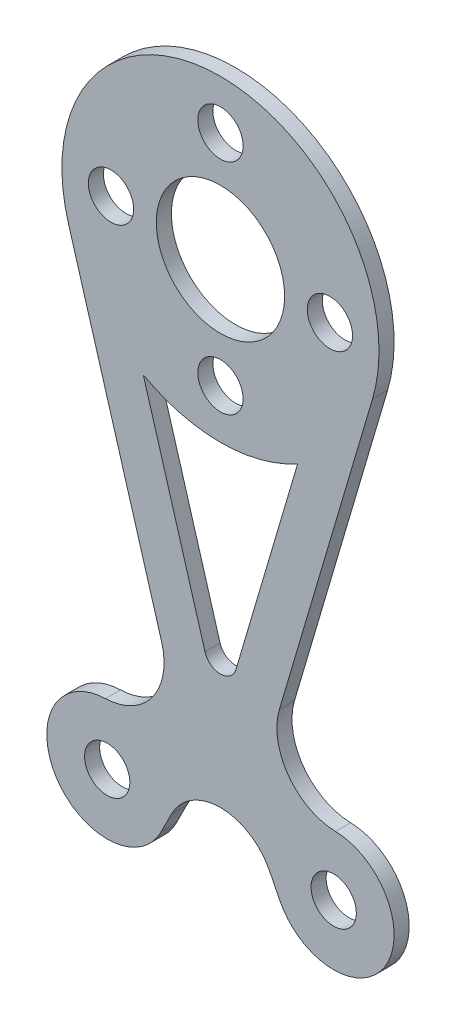
ISO-10303-21;
HEADER;
FILE_DESCRIPTION(('STEP AP214'),'2;1');
FILE_NAME('part.step','',(''),(''),'','','');
FILE_SCHEMA(('AUTOMOTIVE_DESIGN { 1 0 10303 214 1 1 1 1 }'));
ENDSEC;
DATA;
#1=APPLICATION_CONTEXT('core data for automotive mechanical design processes');
#2=APPLICATION_PROTOCOL_DEFINITION('international standard','automotive_design',2000,#1);
#3=PRODUCT_CONTEXT('',#1,'mechanical');
#4=PRODUCT('Part','Part','',(#3));
#5=PRODUCT_RELATED_PRODUCT_CATEGORY('part','',(#4));
#6=PRODUCT_DEFINITION_FORMATION('','',#4);
#7=PRODUCT_DEFINITION_CONTEXT('part definition',#1,'design');
#8=PRODUCT_DEFINITION('design','',#6,#7);
#9=PRODUCT_DEFINITION_SHAPE('','',#8);
#10=(LENGTH_UNIT() NAMED_UNIT(*) SI_UNIT(.MILLI.,.METRE.));
#11=(NAMED_UNIT(*) PLANE_ANGLE_UNIT() SI_UNIT($,.RADIAN.));
#12=(NAMED_UNIT(*) SI_UNIT($,.STERADIAN.) SOLID_ANGLE_UNIT());
#13=UNCERTAINTY_MEASURE_WITH_UNIT(LENGTH_MEASURE(1.E-05),#10,'distance_accuracy_value','');
#14=(GEOMETRIC_REPRESENTATION_CONTEXT(3) GLOBAL_UNCERTAINTY_ASSIGNED_CONTEXT((#13)) GLOBAL_UNIT_ASSIGNED_CONTEXT((#10,
#11,#12)) REPRESENTATION_CONTEXT('',''));
#15=CARTESIAN_POINT('',(0.,0.,0.));
#16=DIRECTION('',(0.,0.,1.));
#17=DIRECTION('',(1.,0.,0.));
#18=AXIS2_PLACEMENT_3D('',#15,#16,#17);
#19=CARTESIAN_POINT('',(-7.5,0.,1.));
#20=DIRECTION('',(0.,0.,1.));
#21=DIRECTION('',(1.,0.,0.));
#22=AXIS2_PLACEMENT_3D('',#19,#20,#21);
#23=PLANE('',#22);
#24=CARTESIAN_POINT('',(7.25,33.,1.));
#25=DIRECTION('',(0.,0.,1.));
#26=DIRECTION('',(1.,0.,0.));
#27=AXIS2_PLACEMENT_3D('',#24,#25,#26);
#28=CIRCLE('',#27,1.5);
#29=CARTESIAN_POINT('',(8.75,33.,1.));
#30=VERTEX_POINT('',#29);
#31=EDGE_CURVE('E172',#30,#30,#28,.T.);
#32=ORIENTED_EDGE('',*,*,#31,.F.);
#33=EDGE_LOOP('',(#32));
#34=FACE_BOUND('',#33,.T.);
#35=CARTESIAN_POINT('',(-7.25,33.,1.));
#36=DIRECTION('',(0.,0.,1.));
#37=DIRECTION('',(1.,0.,0.));
#38=AXIS2_PLACEMENT_3D('',#35,#36,#37);
#39=CIRCLE('',#38,1.5);
#40=CARTESIAN_POINT('',(-5.75,33.,1.));
#41=VERTEX_POINT('',#40);
#42=EDGE_CURVE('E184',#41,#41,#39,.T.);
#43=ORIENTED_EDGE('',*,*,#42,.F.);
#44=EDGE_LOOP('',(#43));
#45=FACE_BOUND('',#44,.T.);
#46=CARTESIAN_POINT('',(0.,33.,1.));
#47=DIRECTION('',(0.,0.,1.));
#48=DIRECTION('',(1.,0.,0.));
#49=AXIS2_PLACEMENT_3D('',#46,#47,#48);
#50=CIRCLE('',#49,4.25000000000001);
#51=CARTESIAN_POINT('',(4.25000000000001,33.,1.));
#52=VERTEX_POINT('',#51);
#53=EDGE_CURVE('E196',#52,#52,#50,.T.);
#54=ORIENTED_EDGE('',*,*,#53,.F.);
#55=EDGE_LOOP('',(#54));
#56=FACE_BOUND('',#55,.T.);
#57=CARTESIAN_POINT('',(-7.5,0.,1.));
#58=DIRECTION('',(0.,0.,1.));
#59=DIRECTION('',(1.,0.,0.));
#60=AXIS2_PLACEMENT_3D('',#57,#58,#59);
#61=CIRCLE('',#60,1.5);
#62=CARTESIAN_POINT('',(-6.,0.,1.));
#63=VERTEX_POINT('',#62);
#64=EDGE_CURVE('E208',#63,#63,#61,.T.);
#65=ORIENTED_EDGE('',*,*,#64,.F.);
#66=EDGE_LOOP('',(#65));
#67=FACE_BOUND('',#66,.T.);
#68=CARTESIAN_POINT('',(-7.5,0.,1.));
#69=DIRECTION('',(0.,0.,1.));
#70=DIRECTION('',(1.,0.,0.));
#71=AXIS2_PLACEMENT_3D('',#68,#69,#70);
#72=CIRCLE('',#71,4.);
#73=CARTESIAN_POINT('',(-7.6181358850956,3.99825510850079,1.));
#74=VERTEX_POINT('',#73);
#75=CARTESIAN_POINT('',(-3.92286350665597,-1.78999846591732,1.));
#76=VERTEX_POINT('',#75);
#77=EDGE_CURVE('E214',#74,#76,#72,.T.);
#78=ORIENTED_EDGE('',*,*,#77,.T.);
#79=DIRECTION('',(0.447499616479331,0.894284123336008,0.));
#80=VECTOR('',#79,1.);
#81=CARTESIAN_POINT('',(-3.92286350665597,-1.78999846591732,1.));
#82=LINE('',#81,#80);
#83=CARTESIAN_POINT('',(-3.25161408193697,-0.448572280913309,1.));
#84=VERTEX_POINT('',#83);
#85=EDGE_CURVE('E217',#76,#84,#82,.T.);
#86=ORIENTED_EDGE('',*,*,#85,.T.);
#87=CARTESIAN_POINT('',(0.,-2.07567938998011,1.));
#88=DIRECTION('',(0.,0.,-1.));
#89=DIRECTION('',(-1.,0.,0.));
#90=AXIS2_PLACEMENT_3D('',#87,#88,#89);
#91=CIRCLE('',#90,3.63599665597021);
#92=CARTESIAN_POINT('',(3.25161408193697,-0.448572280913309,1.));
#93=VERTEX_POINT('',#92);
#94=EDGE_CURVE('E220',#84,#93,#91,.T.);
#95=ORIENTED_EDGE('',*,*,#94,.T.);
#96=DIRECTION('',(0.447499616479331,-0.894284123336008,0.));
#97=VECTOR('',#96,1.);
#98=CARTESIAN_POINT('',(3.25161408193697,-0.448572280913309,1.));
#99=LINE('',#98,#97);
#100=CARTESIAN_POINT('',(3.92286350665597,-1.78999846591732,1.));
#101=VERTEX_POINT('',#100);
#102=EDGE_CURVE('E222',#93,#101,#99,.T.);
#103=ORIENTED_EDGE('',*,*,#102,.T.);
#104=CARTESIAN_POINT('',(7.5,0.,1.));
#105=DIRECTION('',(0.,0.,1.));
#106=DIRECTION('',(1.,0.,0.));
#107=AXIS2_PLACEMENT_3D('',#104,#105,#106);
#108=CIRCLE('',#107,4.);
#109=CARTESIAN_POINT('',(7.6181358850956,3.99825510850079,1.));
#110=VERTEX_POINT('',#109);
#111=EDGE_CURVE('E224',#101,#110,#108,.T.);
#112=ORIENTED_EDGE('',*,*,#111,.T.);
#113=CARTESIAN_POINT('',(7.73627177019119,7.99651021700159,1.));
#114=DIRECTION('',(0.,0.,-1.));
#115=DIRECTION('',(1.,0.,0.));
#116=AXIS2_PLACEMENT_3D('',#113,#114,#115);
#117=CIRCLE('',#116,4.);
#118=CARTESIAN_POINT('',(3.9,9.12921446138055,1.));
#119=VERTEX_POINT('',#118);
#120=EDGE_CURVE('E226',#110,#119,#117,.T.);
#121=ORIENTED_EDGE('',*,*,#120,.T.);
#122=DIRECTION('',(0.283176061094742,0.959067942547798,0.));
#123=VECTOR('',#122,1.);
#124=CARTESIAN_POINT('',(10.0702133967519,30.0266513585052,1.));
#125=LINE('',#124,#123);
#126=CARTESIAN_POINT('',(10.0702133967519,30.0266513585052,1.));
#127=VERTEX_POINT('',#126);
#128=EDGE_CURVE('E228',#119,#127,#125,.T.);
#129=ORIENTED_EDGE('',*,*,#128,.T.);
#130=CARTESIAN_POINT('',(0.,33.,1.));
#131=DIRECTION('',(0.,0.,1.));
#132=DIRECTION('',(1.,0.,0.));
#133=AXIS2_PLACEMENT_3D('',#130,#131,#132);
#134=CIRCLE('',#133,10.5);
#135=CARTESIAN_POINT('',(-10.0702133967519,30.0266513585052,1.));
#136=VERTEX_POINT('',#135);
#137=EDGE_CURVE('E230',#127,#136,#134,.T.);
#138=ORIENTED_EDGE('',*,*,#137,.T.);
#139=DIRECTION('',(0.283176061094742,-0.959067942547798,0.));
#140=VECTOR('',#139,1.);
#141=CARTESIAN_POINT('',(-10.0702133967519,30.0266513585052,1.));
#142=LINE('',#141,#140);
#143=CARTESIAN_POINT('',(-3.9,9.12921446138055,1.));
#144=VERTEX_POINT('',#143);
#145=EDGE_CURVE('E232',#136,#144,#142,.T.);
#146=ORIENTED_EDGE('',*,*,#145,.T.);
#147=CARTESIAN_POINT('',(-7.73627177019119,7.99651021700159,1.));
#148=DIRECTION('',(0.,0.,-1.));
#149=DIRECTION('',(-1.,0.,0.));
#150=AXIS2_PLACEMENT_3D('',#147,#148,#149);
#151=CIRCLE('',#150,4.);
#152=EDGE_CURVE('E234',#144,#74,#151,.T.);
#153=ORIENTED_EDGE('',*,*,#152,.T.);
#154=EDGE_LOOP('',(#78,#86,#95,#103,#112,#121,#129,#138,#146,#153));
#155=FACE_BOUND('',#154,.T.);
#156=CARTESIAN_POINT('',(7.5,0.,1.));
#157=DIRECTION('',(0.,0.,1.));
#158=DIRECTION('',(1.,0.,0.));
#159=AXIS2_PLACEMENT_3D('',#156,#157,#158);
#160=CIRCLE('',#159,1.5);
#161=CARTESIAN_POINT('',(9.,0.,1.));
#162=VERTEX_POINT('',#161);
#163=EDGE_CURVE('E202',#162,#162,#160,.T.);
#164=ORIENTED_EDGE('',*,*,#163,.F.);
#165=EDGE_LOOP('',(#164));
#166=FACE_BOUND('',#165,.T.);
#167=CARTESIAN_POINT('',(0.,40.25,1.));
#168=DIRECTION('',(0.,0.,1.));
#169=DIRECTION('',(1.,0.,0.));
#170=AXIS2_PLACEMENT_3D('',#167,#168,#169);
#171=CIRCLE('',#170,1.5);
#172=CARTESIAN_POINT('',(1.5,40.25,1.));
#173=VERTEX_POINT('',#172);
#174=EDGE_CURVE('E190',#173,#173,#171,.T.);
#175=ORIENTED_EDGE('',*,*,#174,.F.);
#176=EDGE_LOOP('',(#175));
#177=FACE_BOUND('',#176,.T.);
#178=CARTESIAN_POINT('',(0.,25.75,1.));
#179=DIRECTION('',(0.,0.,1.));
#180=DIRECTION('',(1.,0.,0.));
#181=AXIS2_PLACEMENT_3D('',#178,#179,#180);
#182=CIRCLE('',#181,1.5);
#183=CARTESIAN_POINT('',(1.5,25.75,1.));
#184=VERTEX_POINT('',#183);
#185=EDGE_CURVE('E178',#184,#184,#182,.T.);
#186=ORIENTED_EDGE('',*,*,#185,.F.);
#187=EDGE_LOOP('',(#186));
#188=FACE_BOUND('',#187,.T.);
#189=DIRECTION('',(0.283176061094742,-0.959067942547798,0.));
#190=VECTOR('',#189,1.);
#191=CARTESIAN_POINT('',(-5.11209899794855,23.8284982780804,1.));
#192=LINE('',#191,#190);
#193=CARTESIAN_POINT('',(-5.11209899794855,23.8284982780804,1.));
#194=VERTEX_POINT('',#193);
#195=CARTESIAN_POINT('',(-1.0227961723566,9.97874264466478,1.));
#196=VERTEX_POINT('',#195);
#197=EDGE_CURVE('E144',#194,#196,#192,.T.);
#198=ORIENTED_EDGE('',*,*,#197,.F.);
#199=CARTESIAN_POINT('',(0.,33.,1.));
#200=DIRECTION('',(0.,0.,-1.));
#201=DIRECTION('',(1.,0.,0.));
#202=AXIS2_PLACEMENT_3D('',#199,#200,#201);
#203=CIRCLE('',#202,10.5);
#204=CARTESIAN_POINT('',(5.11209899794854,23.8284982780804,1.));
#205=VERTEX_POINT('',#204);
#206=EDGE_CURVE('E136',#205,#194,#203,.T.);
#207=ORIENTED_EDGE('',*,*,#206,.F.);
#208=DIRECTION('',(0.283176061094742,0.959067942547798,0.));
#209=VECTOR('',#208,1.);
#210=CARTESIAN_POINT('',(5.11209899794854,23.8284982780804,1.));
#211=LINE('',#210,#209);
#212=CARTESIAN_POINT('',(1.0227961723566,9.97874264466478,1.));
#213=VERTEX_POINT('',#212);
#214=EDGE_CURVE('E158',#213,#205,#211,.T.);
#215=ORIENTED_EDGE('',*,*,#214,.F.);
#216=CARTESIAN_POINT('',(0.,10.2807352132218,1.));
#217=DIRECTION('',(0.,0.,1.));
#218=DIRECTION('',(1.,0.,0.));
#219=AXIS2_PLACEMENT_3D('',#216,#217,#218);
#220=CIRCLE('',#219,1.06644808671168);
#221=EDGE_CURVE('E156',#196,#213,#220,.T.);
#222=ORIENTED_EDGE('',*,*,#221,.F.);
#223=EDGE_LOOP('',(#198,#207,#215,#222));
#224=FACE_BOUND('',#223,.T.);
#225=ADVANCED_FACE('F35',(#34,#45,#56,#67,#155,#166,#177,#188,#224),#23,.T.);
#226=CARTESIAN_POINT('',(-7.5,0.,0.));
#227=DIRECTION('',(0.,0.,1.));
#228=DIRECTION('',(1.,0.,0.));
#229=AXIS2_PLACEMENT_3D('',#226,#227,#228);
#230=PLANE('',#229);
#231=CARTESIAN_POINT('',(7.25,33.,0.));
#232=DIRECTION('',(0.,0.,1.));
#233=DIRECTION('',(1.,0.,0.));
#234=AXIS2_PLACEMENT_3D('',#231,#232,#233);
#235=CIRCLE('',#234,1.5);
#236=CARTESIAN_POINT('',(8.75,33.,0.));
#237=VERTEX_POINT('',#236);
#238=EDGE_CURVE('E152',#237,#237,#235,.T.);
#239=ORIENTED_EDGE('',*,*,#238,.T.);
#240=EDGE_LOOP('',(#239));
#241=FACE_BOUND('',#240,.T.);
#242=CARTESIAN_POINT('',(-7.25,33.,0.));
#243=DIRECTION('',(0.,0.,1.));
#244=DIRECTION('',(1.,0.,0.));
#245=AXIS2_PLACEMENT_3D('',#242,#243,#244);
#246=CIRCLE('',#245,1.5);
#247=CARTESIAN_POINT('',(-5.75,33.,0.));
#248=VERTEX_POINT('',#247);
#249=EDGE_CURVE('E181',#248,#248,#246,.T.);
#250=ORIENTED_EDGE('',*,*,#249,.T.);
#251=EDGE_LOOP('',(#250));
#252=FACE_BOUND('',#251,.T.);
#253=CARTESIAN_POINT('',(0.,33.,0.));
#254=DIRECTION('',(0.,0.,1.));
#255=DIRECTION('',(1.,0.,0.));
#256=AXIS2_PLACEMENT_3D('',#253,#254,#255);
#257=CIRCLE('',#256,4.25000000000001);
#258=CARTESIAN_POINT('',(4.25000000000001,33.,0.));
#259=VERTEX_POINT('',#258);
#260=EDGE_CURVE('E193',#259,#259,#257,.T.);
#261=ORIENTED_EDGE('',*,*,#260,.T.);
#262=EDGE_LOOP('',(#261));
#263=FACE_BOUND('',#262,.T.);
#264=CARTESIAN_POINT('',(-7.5,0.,0.));
#265=DIRECTION('',(0.,0.,1.));
#266=DIRECTION('',(1.,0.,0.));
#267=AXIS2_PLACEMENT_3D('',#264,#265,#266);
#268=CIRCLE('',#267,1.5);
#269=CARTESIAN_POINT('',(-6.,0.,0.));
#270=VERTEX_POINT('',#269);
#271=EDGE_CURVE('E205',#270,#270,#268,.T.);
#272=ORIENTED_EDGE('',*,*,#271,.T.);
#273=EDGE_LOOP('',(#272));
#274=FACE_BOUND('',#273,.T.);
#275=CARTESIAN_POINT('',(-7.5,0.,0.));
#276=DIRECTION('',(0.,0.,1.));
#277=DIRECTION('',(1.,0.,0.));
#278=AXIS2_PLACEMENT_3D('',#275,#276,#277);
#279=CIRCLE('',#278,4.);
#280=CARTESIAN_POINT('',(-7.6181358850956,3.99825510850079,0.));
#281=VERTEX_POINT('',#280);
#282=CARTESIAN_POINT('',(-3.92286350665597,-1.78999846591732,0.));
#283=VERTEX_POINT('',#282);
#284=EDGE_CURVE('E211',#281,#283,#279,.T.);
#285=ORIENTED_EDGE('',*,*,#284,.F.);
#286=CARTESIAN_POINT('',(-7.73627177019119,7.99651021700159,0.));
#287=DIRECTION('',(0.,0.,-1.));
#288=DIRECTION('',(-1.,0.,0.));
#289=AXIS2_PLACEMENT_3D('',#286,#287,#288);
#290=CIRCLE('',#289,4.);
#291=CARTESIAN_POINT('',(-3.9,9.12921446138055,0.));
#292=VERTEX_POINT('',#291);
#293=EDGE_CURVE('E218',#292,#281,#290,.T.);
#294=ORIENTED_EDGE('',*,*,#293,.F.);
#295=DIRECTION('',(0.283176061094742,-0.959067942547798,0.));
#296=VECTOR('',#295,1.);
#297=CARTESIAN_POINT('',(-10.0702133967519,30.0266513585052,0.));
#298=LINE('',#297,#296);
#299=CARTESIAN_POINT('',(-10.0702133967519,30.0266513585052,0.));
#300=VERTEX_POINT('',#299);
#301=EDGE_CURVE('E253',#300,#292,#298,.T.);
#302=ORIENTED_EDGE('',*,*,#301,.F.);
#303=CARTESIAN_POINT('',(0.,33.,0.));
#304=DIRECTION('',(0.,0.,1.));
#305=DIRECTION('',(1.,0.,0.));
#306=AXIS2_PLACEMENT_3D('',#303,#304,#305);
#307=CIRCLE('',#306,10.5);
#308=CARTESIAN_POINT('',(10.0702133967519,30.0266513585052,0.));
#309=VERTEX_POINT('',#308);
#310=EDGE_CURVE('E251',#309,#300,#307,.T.);
#311=ORIENTED_EDGE('',*,*,#310,.F.);
#312=DIRECTION('',(0.283176061094742,0.959067942547798,0.));
#313=VECTOR('',#312,1.);
#314=CARTESIAN_POINT('',(10.0702133967519,30.0266513585052,0.));
#315=LINE('',#314,#313);
#316=CARTESIAN_POINT('',(3.9,9.12921446138055,0.));
#317=VERTEX_POINT('',#316);
#318=EDGE_CURVE('E249',#317,#309,#315,.T.);
#319=ORIENTED_EDGE('',*,*,#318,.F.);
#320=CARTESIAN_POINT('',(7.73627177019119,7.99651021700159,0.));
#321=DIRECTION('',(0.,0.,-1.));
#322=DIRECTION('',(1.,0.,0.));
#323=AXIS2_PLACEMENT_3D('',#320,#321,#322);
#324=CIRCLE('',#323,4.);
#325=CARTESIAN_POINT('',(7.6181358850956,3.99825510850079,0.));
#326=VERTEX_POINT('',#325);
#327=EDGE_CURVE('E247',#326,#317,#324,.T.);
#328=ORIENTED_EDGE('',*,*,#327,.F.);
#329=CARTESIAN_POINT('',(7.5,0.,0.));
#330=DIRECTION('',(0.,0.,1.));
#331=DIRECTION('',(1.,0.,0.));
#332=AXIS2_PLACEMENT_3D('',#329,#330,#331);
#333=CIRCLE('',#332,4.);
#334=CARTESIAN_POINT('',(3.92286350665597,-1.78999846591732,0.));
#335=VERTEX_POINT('',#334);
#336=EDGE_CURVE('E245',#335,#326,#333,.T.);
#337=ORIENTED_EDGE('',*,*,#336,.F.);
#338=DIRECTION('',(0.447499616479331,-0.894284123336008,0.));
#339=VECTOR('',#338,1.);
#340=CARTESIAN_POINT('',(3.25161408193697,-0.448572280913309,0.));
#341=LINE('',#340,#339);
#342=CARTESIAN_POINT('',(3.25161408193697,-0.448572280913309,0.));
#343=VERTEX_POINT('',#342);
#344=EDGE_CURVE('E243',#343,#335,#341,.T.);
#345=ORIENTED_EDGE('',*,*,#344,.F.);
#346=CARTESIAN_POINT('',(0.,-2.07567938998011,0.));
#347=DIRECTION('',(0.,0.,-1.));
#348=DIRECTION('',(-1.,0.,0.));
#349=AXIS2_PLACEMENT_3D('',#346,#347,#348);
#350=CIRCLE('',#349,3.63599665597021);
#351=CARTESIAN_POINT('',(-3.25161408193697,-0.448572280913309,0.));
#352=VERTEX_POINT('',#351);
#353=EDGE_CURVE('E241',#352,#343,#350,.T.);
#354=ORIENTED_EDGE('',*,*,#353,.F.);
#355=DIRECTION('',(0.447499616479331,0.894284123336008,0.));
#356=VECTOR('',#355,1.);
#357=CARTESIAN_POINT('',(-3.92286350665597,-1.78999846591732,0.));
#358=LINE('',#357,#356);
#359=EDGE_CURVE('E239',#283,#352,#358,.T.);
#360=ORIENTED_EDGE('',*,*,#359,.F.);
#361=EDGE_LOOP('',(#285,#294,#302,#311,#319,#328,#337,#345,#354,#360));
#362=FACE_BOUND('',#361,.T.);
#363=CARTESIAN_POINT('',(7.5,0.,0.));
#364=DIRECTION('',(0.,0.,1.));
#365=DIRECTION('',(1.,0.,0.));
#366=AXIS2_PLACEMENT_3D('',#363,#364,#365);
#367=CIRCLE('',#366,1.5);
#368=CARTESIAN_POINT('',(9.,0.,0.));
#369=VERTEX_POINT('',#368);
#370=EDGE_CURVE('E199',#369,#369,#367,.T.);
#371=ORIENTED_EDGE('',*,*,#370,.T.);
#372=EDGE_LOOP('',(#371));
#373=FACE_BOUND('',#372,.T.);
#374=CARTESIAN_POINT('',(0.,40.25,0.));
#375=DIRECTION('',(0.,0.,1.));
#376=DIRECTION('',(1.,0.,0.));
#377=AXIS2_PLACEMENT_3D('',#374,#375,#376);
#378=CIRCLE('',#377,1.5);
#379=CARTESIAN_POINT('',(1.5,40.25,0.));
#380=VERTEX_POINT('',#379);
#381=EDGE_CURVE('E187',#380,#380,#378,.T.);
#382=ORIENTED_EDGE('',*,*,#381,.T.);
#383=EDGE_LOOP('',(#382));
#384=FACE_BOUND('',#383,.T.);
#385=CARTESIAN_POINT('',(0.,25.75,0.));
#386=DIRECTION('',(0.,0.,1.));
#387=DIRECTION('',(1.,0.,0.));
#388=AXIS2_PLACEMENT_3D('',#385,#386,#387);
#389=CIRCLE('',#388,1.5);
#390=CARTESIAN_POINT('',(1.5,25.75,0.));
#391=VERTEX_POINT('',#390);
#392=EDGE_CURVE('E175',#391,#391,#389,.T.);
#393=ORIENTED_EDGE('',*,*,#392,.T.);
#394=EDGE_LOOP('',(#393));
#395=FACE_BOUND('',#394,.T.);
#396=CARTESIAN_POINT('',(0.,33.,0.));
#397=DIRECTION('',(0.,0.,-1.));
#398=DIRECTION('',(1.,0.,0.));
#399=AXIS2_PLACEMENT_3D('',#396,#397,#398);
#400=CIRCLE('',#399,10.5);
#401=CARTESIAN_POINT('',(5.11209899794854,23.8284982780804,0.));
#402=VERTEX_POINT('',#401);
#403=CARTESIAN_POINT('',(-5.11209899794855,23.8284982780804,0.));
#404=VERTEX_POINT('',#403);
#405=EDGE_CURVE('E58',#402,#404,#400,.T.);
#406=ORIENTED_EDGE('',*,*,#405,.T.);
#407=DIRECTION('',(0.283176061094742,-0.959067942547798,0.));
#408=VECTOR('',#407,1.);
#409=CARTESIAN_POINT('',(-5.11209899794855,23.8284982780804,0.));
#410=LINE('',#409,#408);
#411=CARTESIAN_POINT('',(-1.0227961723566,9.97874264466478,0.));
#412=VERTEX_POINT('',#411);
#413=EDGE_CURVE('E151',#404,#412,#410,.T.);
#414=ORIENTED_EDGE('',*,*,#413,.T.);
#415=CARTESIAN_POINT('',(0.,10.2807352132218,0.));
#416=DIRECTION('',(0.,0.,1.));
#417=DIRECTION('',(1.,0.,0.));
#418=AXIS2_PLACEMENT_3D('',#415,#416,#417);
#419=CIRCLE('',#418,1.06644808671168);
#420=CARTESIAN_POINT('',(1.0227961723566,9.97874264466478,0.));
#421=VERTEX_POINT('',#420);
#422=EDGE_CURVE('E164',#412,#421,#419,.T.);
#423=ORIENTED_EDGE('',*,*,#422,.T.);
#424=DIRECTION('',(0.283176061094742,0.959067942547798,0.));
#425=VECTOR('',#424,1.);
#426=CARTESIAN_POINT('',(5.11209899794854,23.8284982780804,0.));
#427=LINE('',#426,#425);
#428=EDGE_CURVE('E145',#421,#402,#427,.T.);
#429=ORIENTED_EDGE('',*,*,#428,.T.);
#430=EDGE_LOOP('',(#406,#414,#423,#429));
#431=FACE_BOUND('',#430,.T.);
#432=ADVANCED_FACE('F289',(#241,#252,#263,#274,#362,#373,#384,#395,#431),#230,.F.);
#433=CARTESIAN_POINT('',(-7.5,0.,1.));
#434=DIRECTION('',(0.,0.,-1.));
#435=DIRECTION('',(-1.,0.,0.));
#436=AXIS2_PLACEMENT_3D('',#433,#434,#435);
#437=CYLINDRICAL_SURFACE('',#436,4.);
#438=ORIENTED_EDGE('',*,*,#284,.T.);
#439=DIRECTION('',(0.,0.,-1.));
#440=VECTOR('',#439,1.);
#441=CARTESIAN_POINT('',(-3.92286350665597,-1.78999846591732,1.));
#442=LINE('',#441,#440);
#443=EDGE_CURVE('E11',#76,#283,#442,.T.);
#444=ORIENTED_EDGE('',*,*,#443,.F.);
#445=ORIENTED_EDGE('',*,*,#77,.F.);
#446=DIRECTION('',(0.,0.,-1.));
#447=VECTOR('',#446,1.);
#448=CARTESIAN_POINT('',(-7.6181358850956,3.99825510850079,1.));
#449=LINE('',#448,#447);
#450=EDGE_CURVE('E236',#74,#281,#449,.T.);
#451=ORIENTED_EDGE('',*,*,#450,.T.);
#452=EDGE_LOOP('',(#438,#444,#445,#451));
#453=FACE_BOUND('',#452,.T.);
#454=ADVANCED_FACE('F37',(#453),#437,.T.);
#455=CARTESIAN_POINT('',(-3.92286350665597,-1.78999846591732,1.));
#456=DIRECTION('',(-0.894284123336008,0.447499616479331,0.));
#457=DIRECTION('',(-0.447499616479331,-0.894284123336008,0.));
#458=AXIS2_PLACEMENT_3D('',#455,#456,#457);
#459=PLANE('',#458);
#460=ORIENTED_EDGE('',*,*,#359,.T.);
#461=DIRECTION('',(0.,0.,-1.));
#462=VECTOR('',#461,1.);
#463=CARTESIAN_POINT('',(-3.25161408193697,-0.448572280913309,1.));
#464=LINE('',#463,#462);
#465=EDGE_CURVE('E43',#84,#352,#464,.T.);
#466=ORIENTED_EDGE('',*,*,#465,.F.);
#467=ORIENTED_EDGE('',*,*,#85,.F.);
#468=ORIENTED_EDGE('',*,*,#443,.T.);
#469=EDGE_LOOP('',(#460,#466,#467,#468));
#470=FACE_BOUND('',#469,.T.);
#471=ADVANCED_FACE('F307',(#470),#459,.F.);
#472=CARTESIAN_POINT('',(0.,-2.07567938998011,1.));
#473=DIRECTION('',(0.,0.,-1.));
#474=DIRECTION('',(-1.,0.,0.));
#475=AXIS2_PLACEMENT_3D('',#472,#473,#474);
#476=CYLINDRICAL_SURFACE('',#475,3.63599665597021);
#477=ORIENTED_EDGE('',*,*,#353,.T.);
#478=DIRECTION('',(0.,0.,-1.));
#479=VECTOR('',#478,1.);
#480=CARTESIAN_POINT('',(3.25161408193697,-0.448572280913309,1.));
#481=LINE('',#480,#479);
#482=EDGE_CURVE('E276',#93,#343,#481,.T.);
#483=ORIENTED_EDGE('',*,*,#482,.F.);
#484=ORIENTED_EDGE('',*,*,#94,.F.);
#485=ORIENTED_EDGE('',*,*,#465,.T.);
#486=EDGE_LOOP('',(#477,#483,#484,#485));
#487=FACE_BOUND('',#486,.T.);
#488=ADVANCED_FACE('F283',(#487),#476,.F.);
#489=CARTESIAN_POINT('',(3.25161408193697,-0.448572280913309,1.));
#490=DIRECTION('',(0.894284123336008,0.447499616479331,0.));
#491=DIRECTION('',(-0.447499616479331,0.894284123336008,0.));
#492=AXIS2_PLACEMENT_3D('',#489,#490,#491);
#493=PLANE('',#492);
#494=ORIENTED_EDGE('',*,*,#344,.T.);
#495=DIRECTION('',(0.,0.,-1.));
#496=VECTOR('',#495,1.);
#497=CARTESIAN_POINT('',(3.92286350665597,-1.78999846591732,1.));
#498=LINE('',#497,#496);
#499=EDGE_CURVE('E273',#101,#335,#498,.T.);
#500=ORIENTED_EDGE('',*,*,#499,.F.);
#501=ORIENTED_EDGE('',*,*,#102,.F.);
#502=ORIENTED_EDGE('',*,*,#482,.T.);
#503=EDGE_LOOP('',(#494,#500,#501,#502));
#504=FACE_BOUND('',#503,.T.);
#505=ADVANCED_FACE('F295',(#504),#493,.F.);
#506=CARTESIAN_POINT('',(7.5,0.,1.));
#507=DIRECTION('',(0.,0.,-1.));
#508=DIRECTION('',(-1.,0.,0.));
#509=AXIS2_PLACEMENT_3D('',#506,#507,#508);
#510=CYLINDRICAL_SURFACE('',#509,4.);
#511=ORIENTED_EDGE('',*,*,#336,.T.);
#512=DIRECTION('',(0.,0.,-1.));
#513=VECTOR('',#512,1.);
#514=CARTESIAN_POINT('',(7.6181358850956,3.99825510850079,1.));
#515=LINE('',#514,#513);
#516=EDGE_CURVE('E270',#110,#326,#515,.T.);
#517=ORIENTED_EDGE('',*,*,#516,.F.);
#518=ORIENTED_EDGE('',*,*,#111,.F.);
#519=ORIENTED_EDGE('',*,*,#499,.T.);
#520=EDGE_LOOP('',(#511,#517,#518,#519));
#521=FACE_BOUND('',#520,.T.);
#522=ADVANCED_FACE('F299',(#521),#510,.T.);
#523=CARTESIAN_POINT('',(7.73627177019119,7.99651021700159,1.));
#524=DIRECTION('',(0.,0.,-1.));
#525=DIRECTION('',(-1.,0.,0.));
#526=AXIS2_PLACEMENT_3D('',#523,#524,#525);
#527=CYLINDRICAL_SURFACE('',#526,4.);
#528=ORIENTED_EDGE('',*,*,#327,.T.);
#529=DIRECTION('',(0.,0.,-1.));
#530=VECTOR('',#529,1.);
#531=CARTESIAN_POINT('',(3.9,9.12921446138055,1.));
#532=LINE('',#531,#530);
#533=EDGE_CURVE('E267',#119,#317,#532,.T.);
#534=ORIENTED_EDGE('',*,*,#533,.F.);
#535=ORIENTED_EDGE('',*,*,#120,.F.);
#536=ORIENTED_EDGE('',*,*,#516,.T.);
#537=EDGE_LOOP('',(#528,#534,#535,#536));
#538=FACE_BOUND('',#537,.T.);
#539=ADVANCED_FACE('F330',(#538),#527,.F.);
#540=CARTESIAN_POINT('',(10.0702133967519,30.0266513585052,1.));
#541=DIRECTION('',(-0.959067942547798,0.283176061094742,0.));
#542=DIRECTION('',(-0.283176061094742,-0.959067942547798,0.));
#543=AXIS2_PLACEMENT_3D('',#540,#541,#542);
#544=PLANE('',#543);
#545=ORIENTED_EDGE('',*,*,#318,.T.);
#546=DIRECTION('',(0.,0.,-1.));
#547=VECTOR('',#546,1.);
#548=CARTESIAN_POINT('',(10.0702133967519,30.0266513585052,1.));
#549=LINE('',#548,#547);
#550=EDGE_CURVE('E264',#127,#309,#549,.T.);
#551=ORIENTED_EDGE('',*,*,#550,.F.);
#552=ORIENTED_EDGE('',*,*,#128,.F.);
#553=ORIENTED_EDGE('',*,*,#533,.T.);
#554=EDGE_LOOP('',(#545,#551,#552,#553));
#555=FACE_BOUND('',#554,.T.);
#556=ADVANCED_FACE('F327',(#555),#544,.F.);
#557=CARTESIAN_POINT('',(0.,33.,1.));
#558=DIRECTION('',(0.,0.,-1.));
#559=DIRECTION('',(-1.,0.,0.));
#560=AXIS2_PLACEMENT_3D('',#557,#558,#559);
#561=CYLINDRICAL_SURFACE('',#560,10.5);
#562=ORIENTED_EDGE('',*,*,#310,.T.);
#563=DIRECTION('',(0.,0.,-1.));
#564=VECTOR('',#563,1.);
#565=CARTESIAN_POINT('',(-10.0702133967519,30.0266513585052,1.));
#566=LINE('',#565,#564);
#567=EDGE_CURVE('E261',#136,#300,#566,.T.);
#568=ORIENTED_EDGE('',*,*,#567,.F.);
#569=ORIENTED_EDGE('',*,*,#137,.F.);
#570=ORIENTED_EDGE('',*,*,#550,.T.);
#571=EDGE_LOOP('',(#562,#568,#569,#570));
#572=FACE_BOUND('',#571,.T.);
#573=ADVANCED_FACE('F323',(#572),#561,.T.);
#574=CARTESIAN_POINT('',(-10.0702133967519,30.0266513585052,1.));
#575=DIRECTION('',(0.959067942547798,0.283176061094742,0.));
#576=DIRECTION('',(-0.283176061094742,0.959067942547798,0.));
#577=AXIS2_PLACEMENT_3D('',#574,#575,#576);
#578=PLANE('',#577);
#579=ORIENTED_EDGE('',*,*,#301,.T.);
#580=DIRECTION('',(0.,0.,-1.));
#581=VECTOR('',#580,1.);
#582=CARTESIAN_POINT('',(-3.9,9.12921446138055,1.));
#583=LINE('',#582,#581);
#584=EDGE_CURVE('E258',#144,#292,#583,.T.);
#585=ORIENTED_EDGE('',*,*,#584,.F.);
#586=ORIENTED_EDGE('',*,*,#145,.F.);
#587=ORIENTED_EDGE('',*,*,#567,.T.);
#588=EDGE_LOOP('',(#579,#585,#586,#587));
#589=FACE_BOUND('',#588,.T.);
#590=ADVANCED_FACE('F319',(#589),#578,.F.);
#591=CARTESIAN_POINT('',(-7.73627177019119,7.99651021700159,1.));
#592=DIRECTION('',(0.,0.,-1.));
#593=DIRECTION('',(-1.,0.,0.));
#594=AXIS2_PLACEMENT_3D('',#591,#592,#593);
#595=CYLINDRICAL_SURFACE('',#594,4.);
#596=ORIENTED_EDGE('',*,*,#293,.T.);
#597=ORIENTED_EDGE('',*,*,#450,.F.);
#598=ORIENTED_EDGE('',*,*,#152,.F.);
#599=ORIENTED_EDGE('',*,*,#584,.T.);
#600=EDGE_LOOP('',(#596,#597,#598,#599));
#601=FACE_BOUND('',#600,.T.);
#602=ADVANCED_FACE('F314',(#601),#595,.F.);
#603=CARTESIAN_POINT('',(-7.5,0.,1.));
#604=DIRECTION('',(0.,0.,-1.));
#605=DIRECTION('',(-1.,0.,0.));
#606=AXIS2_PLACEMENT_3D('',#603,#604,#605);
#607=CYLINDRICAL_SURFACE('',#606,1.5);
#608=ORIENTED_EDGE('',*,*,#64,.T.);
#609=EDGE_LOOP('',(#608));
#610=FACE_BOUND('',#609,.T.);
#611=ORIENTED_EDGE('',*,*,#271,.F.);
#612=EDGE_LOOP('',(#611));
#613=FACE_BOUND('',#612,.T.);
#614=ADVANCED_FACE('F350',(#610,#613),#607,.F.);
#615=CARTESIAN_POINT('',(7.5,0.,1.));
#616=DIRECTION('',(0.,0.,-1.));
#617=DIRECTION('',(-1.,0.,0.));
#618=AXIS2_PLACEMENT_3D('',#615,#616,#617);
#619=CYLINDRICAL_SURFACE('',#618,1.5);
#620=ORIENTED_EDGE('',*,*,#163,.T.);
#621=EDGE_LOOP('',(#620));
#622=FACE_BOUND('',#621,.T.);
#623=ORIENTED_EDGE('',*,*,#370,.F.);
#624=EDGE_LOOP('',(#623));
#625=FACE_BOUND('',#624,.T.);
#626=ADVANCED_FACE('F376',(#622,#625),#619,.F.);
#627=CARTESIAN_POINT('',(0.,33.,1.));
#628=DIRECTION('',(0.,0.,-1.));
#629=DIRECTION('',(-1.,0.,0.));
#630=AXIS2_PLACEMENT_3D('',#627,#628,#629);
#631=CYLINDRICAL_SURFACE('',#630,4.25000000000001);
#632=ORIENTED_EDGE('',*,*,#53,.T.);
#633=EDGE_LOOP('',(#632));
#634=FACE_BOUND('',#633,.T.);
#635=ORIENTED_EDGE('',*,*,#260,.F.);
#636=EDGE_LOOP('',(#635));
#637=FACE_BOUND('',#636,.T.);
#638=ADVANCED_FACE('F383',(#634,#637),#631,.F.);
#639=CARTESIAN_POINT('',(0.,40.25,1.));
#640=DIRECTION('',(0.,0.,-1.));
#641=DIRECTION('',(-1.,0.,0.));
#642=AXIS2_PLACEMENT_3D('',#639,#640,#641);
#643=CYLINDRICAL_SURFACE('',#642,1.5);
#644=ORIENTED_EDGE('',*,*,#174,.T.);
#645=EDGE_LOOP('',(#644));
#646=FACE_BOUND('',#645,.T.);
#647=ORIENTED_EDGE('',*,*,#381,.F.);
#648=EDGE_LOOP('',(#647));
#649=FACE_BOUND('',#648,.T.);
#650=ADVANCED_FACE('F390',(#646,#649),#643,.F.);
#651=CARTESIAN_POINT('',(-7.25,33.,1.));
#652=DIRECTION('',(0.,0.,-1.));
#653=DIRECTION('',(-1.,0.,0.));
#654=AXIS2_PLACEMENT_3D('',#651,#652,#653);
#655=CYLINDRICAL_SURFACE('',#654,1.5);
#656=ORIENTED_EDGE('',*,*,#42,.T.);
#657=EDGE_LOOP('',(#656));
#658=FACE_BOUND('',#657,.T.);
#659=ORIENTED_EDGE('',*,*,#249,.F.);
#660=EDGE_LOOP('',(#659));
#661=FACE_BOUND('',#660,.T.);
#662=ADVANCED_FACE('F398',(#658,#661),#655,.F.);
#663=CARTESIAN_POINT('',(0.,25.75,1.));
#664=DIRECTION('',(0.,0.,-1.));
#665=DIRECTION('',(-1.,0.,0.));
#666=AXIS2_PLACEMENT_3D('',#663,#664,#665);
#667=CYLINDRICAL_SURFACE('',#666,1.5);
#668=ORIENTED_EDGE('',*,*,#185,.T.);
#669=EDGE_LOOP('',(#668));
#670=FACE_BOUND('',#669,.T.);
#671=ORIENTED_EDGE('',*,*,#392,.F.);
#672=EDGE_LOOP('',(#671));
#673=FACE_BOUND('',#672,.T.);
#674=ADVANCED_FACE('F406',(#670,#673),#667,.F.);
#675=CARTESIAN_POINT('',(7.25,33.,1.));
#676=DIRECTION('',(0.,0.,-1.));
#677=DIRECTION('',(-1.,0.,0.));
#678=AXIS2_PLACEMENT_3D('',#675,#676,#677);
#679=CYLINDRICAL_SURFACE('',#678,1.5);
#680=ORIENTED_EDGE('',*,*,#31,.T.);
#681=EDGE_LOOP('',(#680));
#682=FACE_BOUND('',#681,.T.);
#683=ORIENTED_EDGE('',*,*,#238,.F.);
#684=EDGE_LOOP('',(#683));
#685=FACE_BOUND('',#684,.T.);
#686=ADVANCED_FACE('F414',(#682,#685),#679,.F.);
#687=CARTESIAN_POINT('',(0.,33.,1.));
#688=DIRECTION('',(0.,0.,-1.));
#689=DIRECTION('',(-1.,0.,0.));
#690=AXIS2_PLACEMENT_3D('',#687,#688,#689);
#691=CYLINDRICAL_SURFACE('',#690,10.5);
#692=ORIENTED_EDGE('',*,*,#405,.F.);
#693=DIRECTION('',(0.,0.,-1.));
#694=VECTOR('',#693,1.);
#695=CARTESIAN_POINT('',(5.11209899794854,23.8284982780804,1.));
#696=LINE('',#695,#694);
#697=EDGE_CURVE('E140',#205,#402,#696,.T.);
#698=ORIENTED_EDGE('',*,*,#697,.F.);
#699=ORIENTED_EDGE('',*,*,#206,.T.);
#700=DIRECTION('',(0.,0.,-1.));
#701=VECTOR('',#700,1.);
#702=CARTESIAN_POINT('',(-5.11209899794855,23.8284982780804,1.));
#703=LINE('',#702,#701);
#704=EDGE_CURVE('E139',#194,#404,#703,.T.);
#705=ORIENTED_EDGE('',*,*,#704,.T.);
#706=EDGE_LOOP('',(#692,#698,#699,#705));
#707=FACE_BOUND('',#706,.T.);
#708=ADVANCED_FACE('F138',(#707),#691,.T.);
#709=CARTESIAN_POINT('',(-5.11209899794855,23.8284982780804,1.));
#710=DIRECTION('',(0.959067942547798,0.283176061094742,0.));
#711=DIRECTION('',(-0.283176061094742,0.959067942547798,0.));
#712=AXIS2_PLACEMENT_3D('',#709,#710,#711);
#713=PLANE('',#712);
#714=ORIENTED_EDGE('',*,*,#413,.F.);
#715=ORIENTED_EDGE('',*,*,#704,.F.);
#716=ORIENTED_EDGE('',*,*,#197,.T.);
#717=DIRECTION('',(0.,0.,-1.));
#718=VECTOR('',#717,1.);
#719=CARTESIAN_POINT('',(-1.0227961723566,9.97874264466478,1.));
#720=LINE('',#719,#718);
#721=EDGE_CURVE('E153',#196,#412,#720,.T.);
#722=ORIENTED_EDGE('',*,*,#721,.T.);
#723=EDGE_LOOP('',(#714,#715,#716,#722));
#724=FACE_BOUND('',#723,.T.);
#725=ADVANCED_FACE('F148',(#724),#713,.T.);
#726=CARTESIAN_POINT('',(0.,10.2807352132218,1.));
#727=DIRECTION('',(0.,0.,-1.));
#728=DIRECTION('',(-1.,0.,0.));
#729=AXIS2_PLACEMENT_3D('',#726,#727,#728);
#730=CYLINDRICAL_SURFACE('',#729,1.06644808671168);
#731=ORIENTED_EDGE('',*,*,#422,.F.);
#732=ORIENTED_EDGE('',*,*,#721,.F.);
#733=ORIENTED_EDGE('',*,*,#221,.T.);
#734=DIRECTION('',(0.,0.,-1.));
#735=VECTOR('',#734,1.);
#736=CARTESIAN_POINT('',(1.0227961723566,9.97874264466478,1.));
#737=LINE('',#736,#735);
#738=EDGE_CURVE('E50',#213,#421,#737,.T.);
#739=ORIENTED_EDGE('',*,*,#738,.T.);
#740=EDGE_LOOP('',(#731,#732,#733,#739));
#741=FACE_BOUND('',#740,.T.);
#742=ADVANCED_FACE('F435',(#741),#730,.F.);
#743=CARTESIAN_POINT('',(5.11209899794854,23.8284982780804,1.));
#744=DIRECTION('',(-0.959067942547798,0.283176061094742,0.));
#745=DIRECTION('',(-0.283176061094742,-0.959067942547798,0.));
#746=AXIS2_PLACEMENT_3D('',#743,#744,#745);
#747=PLANE('',#746);
#748=ORIENTED_EDGE('',*,*,#428,.F.);
#749=ORIENTED_EDGE('',*,*,#738,.F.);
#750=ORIENTED_EDGE('',*,*,#214,.T.);
#751=ORIENTED_EDGE('',*,*,#697,.T.);
#752=EDGE_LOOP('',(#748,#749,#750,#751));
#753=FACE_BOUND('',#752,.T.);
#754=ADVANCED_FACE('F442',(#753),#747,.T.);
#755=CLOSED_SHELL('',(#225,#432,#454,#471,#488,#505,#522,#539,#556,#573,#590,#602,#614,#626,
#638,#650,#662,#674,#686,#708,#725,#742,#754));
#756=MANIFOLD_SOLID_BREP('B2',#755);
#757=ADVANCED_BREP_SHAPE_REPRESENTATION('',(#18,#756),#14);
#758=SHAPE_DEFINITION_REPRESENTATION(#9,#757);
ENDSEC;
END-ISO-10303-21;
